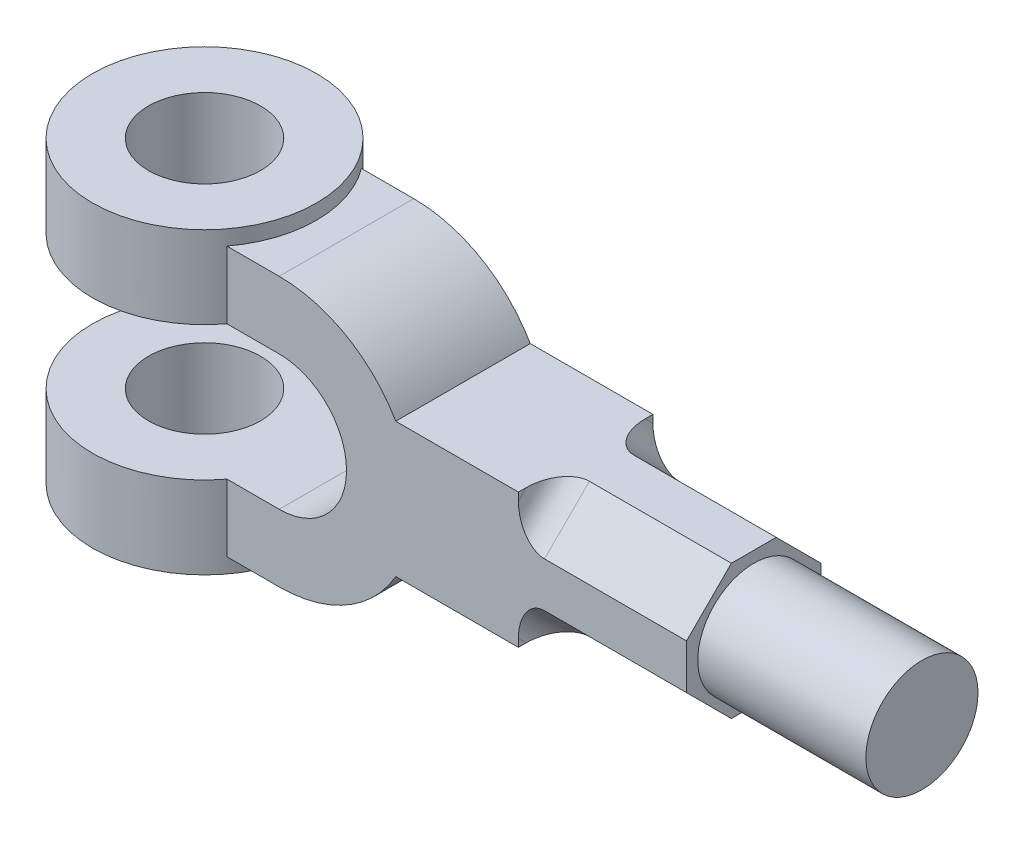
ISO-10303-21;
HEADER;
FILE_DESCRIPTION(('STEP AP214'),'2;1');
FILE_NAME('part.step','',(''),(''),'','','');
FILE_SCHEMA(('AUTOMOTIVE_DESIGN { 1 0 10303 214 1 1 1 1 }'));
ENDSEC;
DATA;
#1=APPLICATION_CONTEXT('core data for automotive mechanical design processes');
#2=APPLICATION_PROTOCOL_DEFINITION('international standard','automotive_design',2000,#1);
#3=PRODUCT_CONTEXT('',#1,'mechanical');
#4=PRODUCT('Part','Part','',(#3));
#5=PRODUCT_RELATED_PRODUCT_CATEGORY('part','',(#4));
#6=PRODUCT_DEFINITION_FORMATION('','',#4);
#7=PRODUCT_DEFINITION_CONTEXT('part definition',#1,'design');
#8=PRODUCT_DEFINITION('design','',#6,#7);
#9=PRODUCT_DEFINITION_SHAPE('','',#8);
#10=(LENGTH_UNIT() NAMED_UNIT(*) SI_UNIT(.MILLI.,.METRE.));
#11=(NAMED_UNIT(*) PLANE_ANGLE_UNIT() SI_UNIT($,.RADIAN.));
#12=(NAMED_UNIT(*) SI_UNIT($,.STERADIAN.) SOLID_ANGLE_UNIT());
#13=UNCERTAINTY_MEASURE_WITH_UNIT(LENGTH_MEASURE(1.E-05),#10,'distance_accuracy_value','');
#14=(GEOMETRIC_REPRESENTATION_CONTEXT(3) GLOBAL_UNCERTAINTY_ASSIGNED_CONTEXT((#13)) GLOBAL_UNIT_ASSIGNED_CONTEXT((#10,
#11,#12)) REPRESENTATION_CONTEXT('',''));
#15=CARTESIAN_POINT('',(0.,0.,0.));
#16=DIRECTION('',(0.,0.,1.));
#17=DIRECTION('',(1.,0.,0.));
#18=AXIS2_PLACEMENT_3D('',#15,#16,#17);
#19=CARTESIAN_POINT('',(0.,0.,18.));
#20=DIRECTION('',(0.,0.,-1.));
#21=DIRECTION('',(-1.,0.,0.));
#22=AXIS2_PLACEMENT_3D('',#19,#20,#21);
#23=CYLINDRICAL_SURFACE('',#22,36.);
#24=CARTESIAN_POINT('',(0.,0.,-18.));
#25=DIRECTION('',(0.,0.,1.));
#26=DIRECTION('',(1.,0.,0.));
#27=AXIS2_PLACEMENT_3D('',#24,#25,#26);
#28=CIRCLE('',#27,36.);
#29=CARTESIAN_POINT('',(31.1769145362398,18.,-18.));
#30=VERTEX_POINT('',#29);
#31=CARTESIAN_POINT('',(0.,36.,-18.));
#32=VERTEX_POINT('',#31);
#33=EDGE_CURVE('E486',#30,#32,#28,.T.);
#34=ORIENTED_EDGE('',*,*,#33,.T.);
#35=DIRECTION('',(0.,0.,-1.));
#36=VECTOR('',#35,1.);
#37=CARTESIAN_POINT('',(0.,36.,18.));
#38=LINE('',#37,#36);
#39=CARTESIAN_POINT('',(0.,36.,18.));
#40=VERTEX_POINT('',#39);
#41=EDGE_CURVE('E278',#40,#32,#38,.T.);
#42=ORIENTED_EDGE('',*,*,#41,.F.);
#43=CARTESIAN_POINT('',(0.,0.,18.));
#44=DIRECTION('',(0.,0.,1.));
#45=DIRECTION('',(1.,0.,0.));
#46=AXIS2_PLACEMENT_3D('',#43,#44,#45);
#47=CIRCLE('',#46,36.);
#48=CARTESIAN_POINT('',(31.1769145362398,18.,18.));
#49=VERTEX_POINT('',#48);
#50=EDGE_CURVE('E244',#49,#40,#47,.T.);
#51=ORIENTED_EDGE('',*,*,#50,.F.);
#52=DIRECTION('',(0.,0.,-1.));
#53=VECTOR('',#52,1.);
#54=CARTESIAN_POINT('',(31.1769145362398,18.,18.));
#55=LINE('',#54,#53);
#56=EDGE_CURVE('E251',#49,#30,#55,.T.);
#57=ORIENTED_EDGE('',*,*,#56,.T.);
#58=EDGE_LOOP('',(#34,#42,#51,#57));
#59=FACE_BOUND('',#58,.T.);
#60=ADVANCED_FACE('F43',(#59),#23,.T.);
#61=CARTESIAN_POINT('',(0.,36.,18.));
#62=DIRECTION('',(0.,-1.,0.));
#63=DIRECTION('',(1.,0.,0.));
#64=AXIS2_PLACEMENT_3D('',#61,#62,#63);
#65=PLANE('',#64);
#66=DIRECTION('',(-1.,0.,0.));
#67=VECTOR('',#66,1.);
#68=CARTESIAN_POINT('',(0.,36.,-18.));
#69=LINE('',#68,#67);
#70=CARTESIAN_POINT('',(-14.,36.,-18.));
#71=VERTEX_POINT('',#70);
#72=EDGE_CURVE('E521',#32,#71,#69,.T.);
#73=ORIENTED_EDGE('',*,*,#72,.T.);
#74=CARTESIAN_POINT('',(-38.,36.,0.));
#75=DIRECTION('',(0.,-1.,0.));
#76=DIRECTION('',(1.,0.,0.));
#77=AXIS2_PLACEMENT_3D('',#74,#75,#76);
#78=CIRCLE('',#77,30.);
#79=CARTESIAN_POINT('',(-14.,36.,18.));
#80=VERTEX_POINT('',#79);
#81=EDGE_CURVE('E477',#71,#80,#78,.T.);
#82=ORIENTED_EDGE('',*,*,#81,.T.);
#83=DIRECTION('',(-1.,0.,0.));
#84=VECTOR('',#83,1.);
#85=CARTESIAN_POINT('',(0.,36.,18.));
#86=LINE('',#85,#84);
#87=EDGE_CURVE('E490',#40,#80,#86,.T.);
#88=ORIENTED_EDGE('',*,*,#87,.F.);
#89=ORIENTED_EDGE('',*,*,#41,.T.);
#90=EDGE_LOOP('',(#73,#82,#88,#89));
#91=FACE_BOUND('',#90,.T.);
#92=ADVANCED_FACE('F365',(#91),#65,.F.);
#93=CARTESIAN_POINT('',(0.,18.,18.));
#94=DIRECTION('',(0.,1.,0.));
#95=DIRECTION('',(0.,0.,1.));
#96=AXIS2_PLACEMENT_3D('',#93,#94,#95);
#97=PLANE('',#96);
#98=CARTESIAN_POINT('',(-38.,18.,0.));
#99=DIRECTION('',(0.,1.,0.));
#100=DIRECTION('',(0.,0.,1.));
#101=AXIS2_PLACEMENT_3D('',#98,#99,#100);
#102=CIRCLE('',#101,15.);
#103=CARTESIAN_POINT('',(-38.,18.,15.));
#104=VERTEX_POINT('',#103);
#105=EDGE_CURVE('E453',#104,#104,#102,.T.);
#106=ORIENTED_EDGE('',*,*,#105,.T.);
#107=EDGE_LOOP('',(#106));
#108=FACE_BOUND('',#107,.T.);
#109=DIRECTION('',(1.,0.,0.));
#110=VECTOR('',#109,1.);
#111=CARTESIAN_POINT('',(0.,18.,18.));
#112=LINE('',#111,#110);
#113=CARTESIAN_POINT('',(-14.,18.,18.));
#114=VERTEX_POINT('',#113);
#115=CARTESIAN_POINT('',(0.,18.,18.));
#116=VERTEX_POINT('',#115);
#117=EDGE_CURVE('E494',#114,#116,#112,.T.);
#118=ORIENTED_EDGE('',*,*,#117,.F.);
#119=CARTESIAN_POINT('',(-38.,18.,0.));
#120=DIRECTION('',(0.,-1.,0.));
#121=DIRECTION('',(0.,0.,-1.));
#122=AXIS2_PLACEMENT_3D('',#119,#120,#121);
#123=CIRCLE('',#122,30.);
#124=CARTESIAN_POINT('',(-14.,18.,-18.));
#125=VERTEX_POINT('',#124);
#126=EDGE_CURVE('E472',#114,#125,#123,.T.);
#127=ORIENTED_EDGE('',*,*,#126,.T.);
#128=DIRECTION('',(1.,0.,0.));
#129=VECTOR('',#128,1.);
#130=CARTESIAN_POINT('',(0.,18.,-18.));
#131=LINE('',#130,#129);
#132=CARTESIAN_POINT('',(0.,18.,-18.));
#133=VERTEX_POINT('',#132);
#134=EDGE_CURVE('E525',#125,#133,#131,.T.);
#135=ORIENTED_EDGE('',*,*,#134,.T.);
#136=DIRECTION('',(0.,0.,-1.));
#137=VECTOR('',#136,1.);
#138=CARTESIAN_POINT('',(0.,18.,18.));
#139=LINE('',#138,#137);
#140=EDGE_CURVE('E274',#116,#133,#139,.T.);
#141=ORIENTED_EDGE('',*,*,#140,.F.);
#142=EDGE_LOOP('',(#118,#127,#135,#141));
#143=FACE_BOUND('',#142,.T.);
#144=ADVANCED_FACE('F371',(#108,#143),#97,.F.);
#145=CARTESIAN_POINT('',(0.,0.,18.));
#146=DIRECTION('',(0.,0.,-1.));
#147=DIRECTION('',(-1.,0.,0.));
#148=AXIS2_PLACEMENT_3D('',#145,#146,#147);
#149=CYLINDRICAL_SURFACE('',#148,18.);
#150=CARTESIAN_POINT('',(0.,0.,-18.));
#151=DIRECTION('',(0.,0.,-1.));
#152=DIRECTION('',(1.,0.,0.));
#153=AXIS2_PLACEMENT_3D('',#150,#151,#152);
#154=CIRCLE('',#153,18.);
#155=CARTESIAN_POINT('',(0.,-18.,-18.));
#156=VERTEX_POINT('',#155);
#157=EDGE_CURVE('E528',#133,#156,#154,.T.);
#158=ORIENTED_EDGE('',*,*,#157,.T.);
#159=DIRECTION('',(0.,0.,-1.));
#160=VECTOR('',#159,1.);
#161=CARTESIAN_POINT('',(0.,-18.,18.));
#162=LINE('',#161,#160);
#163=CARTESIAN_POINT('',(0.,-18.,18.));
#164=VERTEX_POINT('',#163);
#165=EDGE_CURVE('E270',#164,#156,#162,.T.);
#166=ORIENTED_EDGE('',*,*,#165,.F.);
#167=CARTESIAN_POINT('',(0.,0.,18.));
#168=DIRECTION('',(0.,0.,-1.));
#169=DIRECTION('',(1.,0.,0.));
#170=AXIS2_PLACEMENT_3D('',#167,#168,#169);
#171=CIRCLE('',#170,18.);
#172=EDGE_CURVE('E497',#116,#164,#171,.T.);
#173=ORIENTED_EDGE('',*,*,#172,.F.);
#174=ORIENTED_EDGE('',*,*,#140,.T.);
#175=EDGE_LOOP('',(#158,#166,#173,#174));
#176=FACE_BOUND('',#175,.T.);
#177=ADVANCED_FACE('F563',(#176),#149,.F.);
#178=CARTESIAN_POINT('',(0.,-18.,18.));
#179=DIRECTION('',(0.,-1.,0.));
#180=DIRECTION('',(1.,0.,0.));
#181=AXIS2_PLACEMENT_3D('',#178,#179,#180);
#182=PLANE('',#181);
#183=CARTESIAN_POINT('',(-38.,-18.,0.));
#184=DIRECTION('',(0.,-1.,0.));
#185=DIRECTION('',(1.,0.,0.));
#186=AXIS2_PLACEMENT_3D('',#183,#184,#185);
#187=CIRCLE('',#186,15.);
#188=CARTESIAN_POINT('',(-23.,-18.,0.));
#189=VERTEX_POINT('',#188);
#190=EDGE_CURVE('E446',#189,#189,#187,.T.);
#191=ORIENTED_EDGE('',*,*,#190,.T.);
#192=EDGE_LOOP('',(#191));
#193=FACE_BOUND('',#192,.T.);
#194=DIRECTION('',(-1.,0.,0.));
#195=VECTOR('',#194,1.);
#196=CARTESIAN_POINT('',(0.,-18.,-18.));
#197=LINE('',#196,#195);
#198=CARTESIAN_POINT('',(-14.,-18.,-18.));
#199=VERTEX_POINT('',#198);
#200=EDGE_CURVE('E531',#156,#199,#197,.T.);
#201=ORIENTED_EDGE('',*,*,#200,.T.);
#202=CARTESIAN_POINT('',(-38.,-18.,0.));
#203=DIRECTION('',(0.,1.,0.));
#204=DIRECTION('',(-1.,0.,0.));
#205=AXIS2_PLACEMENT_3D('',#202,#203,#204);
#206=CIRCLE('',#205,30.);
#207=CARTESIAN_POINT('',(-14.,-18.,18.));
#208=VERTEX_POINT('',#207);
#209=EDGE_CURVE('E457',#199,#208,#206,.T.);
#210=ORIENTED_EDGE('',*,*,#209,.T.);
#211=DIRECTION('',(-1.,0.,0.));
#212=VECTOR('',#211,1.);
#213=CARTESIAN_POINT('',(0.,-18.,18.));
#214=LINE('',#213,#212);
#215=EDGE_CURVE('E500',#164,#208,#214,.T.);
#216=ORIENTED_EDGE('',*,*,#215,.F.);
#217=ORIENTED_EDGE('',*,*,#165,.T.);
#218=EDGE_LOOP('',(#201,#210,#216,#217));
#219=FACE_BOUND('',#218,.T.);
#220=ADVANCED_FACE('F558',(#193,#219),#182,.F.);
#221=CARTESIAN_POINT('',(0.,-36.,18.));
#222=DIRECTION('',(0.,1.,0.));
#223=DIRECTION('',(0.,0.,1.));
#224=AXIS2_PLACEMENT_3D('',#221,#222,#223);
#225=PLANE('',#224);
#226=DIRECTION('',(1.,0.,0.));
#227=VECTOR('',#226,1.);
#228=CARTESIAN_POINT('',(0.,-36.,18.));
#229=LINE('',#228,#227);
#230=CARTESIAN_POINT('',(-14.,-36.,18.));
#231=VERTEX_POINT('',#230);
#232=CARTESIAN_POINT('',(0.,-36.,18.));
#233=VERTEX_POINT('',#232);
#234=EDGE_CURVE('E504',#231,#233,#229,.T.);
#235=ORIENTED_EDGE('',*,*,#234,.F.);
#236=CARTESIAN_POINT('',(-38.,-36.,0.));
#237=DIRECTION('',(0.,1.,0.));
#238=DIRECTION('',(0.,0.,1.));
#239=AXIS2_PLACEMENT_3D('',#236,#237,#238);
#240=CIRCLE('',#239,30.);
#241=CARTESIAN_POINT('',(-14.,-36.,-18.));
#242=VERTEX_POINT('',#241);
#243=EDGE_CURVE('E462',#231,#242,#240,.T.);
#244=ORIENTED_EDGE('',*,*,#243,.T.);
#245=DIRECTION('',(1.,0.,0.));
#246=VECTOR('',#245,1.);
#247=CARTESIAN_POINT('',(0.,-36.,-18.));
#248=LINE('',#247,#246);
#249=CARTESIAN_POINT('',(0.,-36.,-18.));
#250=VERTEX_POINT('',#249);
#251=EDGE_CURVE('E535',#242,#250,#248,.T.);
#252=ORIENTED_EDGE('',*,*,#251,.T.);
#253=DIRECTION('',(0.,0.,-1.));
#254=VECTOR('',#253,1.);
#255=CARTESIAN_POINT('',(0.,-36.,18.));
#256=LINE('',#255,#254);
#257=EDGE_CURVE('E266',#233,#250,#256,.T.);
#258=ORIENTED_EDGE('',*,*,#257,.F.);
#259=EDGE_LOOP('',(#235,#244,#252,#258));
#260=FACE_BOUND('',#259,.T.);
#261=ADVANCED_FACE('F553',(#260),#225,.F.);
#262=CARTESIAN_POINT('',(0.,0.,18.));
#263=DIRECTION('',(0.,0.,-1.));
#264=DIRECTION('',(-1.,0.,0.));
#265=AXIS2_PLACEMENT_3D('',#262,#263,#264);
#266=CYLINDRICAL_SURFACE('',#265,36.);
#267=CARTESIAN_POINT('',(0.,0.,-18.));
#268=DIRECTION('',(0.,0.,1.));
#269=DIRECTION('',(1.,0.,0.));
#270=AXIS2_PLACEMENT_3D('',#267,#268,#269);
#271=CIRCLE('',#270,36.);
#272=CARTESIAN_POINT('',(31.1769145362398,-18.,-18.));
#273=VERTEX_POINT('',#272);
#274=EDGE_CURVE('E247',#250,#273,#271,.T.);
#275=ORIENTED_EDGE('',*,*,#274,.T.);
#276=DIRECTION('',(0.,0.,-1.));
#277=VECTOR('',#276,1.);
#278=CARTESIAN_POINT('',(31.1769145362398,-18.,18.));
#279=LINE('',#278,#277);
#280=CARTESIAN_POINT('',(31.1769145362398,-18.,18.));
#281=VERTEX_POINT('',#280);
#282=EDGE_CURVE('E262',#281,#273,#279,.T.);
#283=ORIENTED_EDGE('',*,*,#282,.F.);
#284=CARTESIAN_POINT('',(0.,0.,18.));
#285=DIRECTION('',(0.,0.,1.));
#286=DIRECTION('',(1.,0.,0.));
#287=AXIS2_PLACEMENT_3D('',#284,#285,#286);
#288=CIRCLE('',#287,36.);
#289=EDGE_CURVE('E507',#233,#281,#288,.T.);
#290=ORIENTED_EDGE('',*,*,#289,.F.);
#291=ORIENTED_EDGE('',*,*,#257,.T.);
#292=EDGE_LOOP('',(#275,#283,#290,#291));
#293=FACE_BOUND('',#292,.T.);
#294=ADVANCED_FACE('F541',(#293),#266,.T.);
#295=CARTESIAN_POINT('',(31.1769145362398,-18.,18.));
#296=DIRECTION('',(0.,1.,0.));
#297=DIRECTION('',(0.,0.,1.));
#298=AXIS2_PLACEMENT_3D('',#295,#296,#297);
#299=PLANE('',#298);
#300=DIRECTION('',(0.,0.,-1.));
#301=VECTOR('',#300,1.);
#302=CARTESIAN_POINT('',(109.,-18.,18.));
#303=LINE('',#302,#301);
#304=CARTESIAN_POINT('',(109.,-18.0000000000002,5.9999999999995));
#305=VERTEX_POINT('',#304);
#306=CARTESIAN_POINT('',(109.,-17.9999999999998,-6.00000000000033));
#307=VERTEX_POINT('',#306);
#308=EDGE_CURVE('E229',#305,#307,#303,.T.);
#309=ORIENTED_EDGE('',*,*,#308,.F.);
#310=DIRECTION('',(1.,0.,0.));
#311=VECTOR('',#310,1.);
#312=CARTESIAN_POINT('',(64.,-18.0000000000002,5.9999999999995));
#313=LINE('',#312,#311);
#314=CARTESIAN_POINT('',(71.,-18.0000000000002,5.9999999999995));
#315=VERTEX_POINT('',#314);
#316=EDGE_CURVE('E404',#315,#305,#313,.T.);
#317=ORIENTED_EDGE('',*,*,#316,.F.);
#318=CARTESIAN_POINT('',(71.,-18.,15.8994949366113));
#319=DIRECTION('',(0.,1.,0.));
#320=DIRECTION('',(0.,0.,1.));
#321=AXIS2_PLACEMENT_3D('',#318,#319,#320);
#322=ELLIPSE('',#321,9.89949493661167,7.);
#323=CARTESIAN_POINT('',(64.,-18.0000000000002,15.8994949366112));
#324=VERTEX_POINT('',#323);
#325=EDGE_CURVE('E319',#315,#324,#322,.T.);
#326=ORIENTED_EDGE('',*,*,#325,.T.);
#327=DIRECTION('',(0.,0.,-1.));
#328=VECTOR('',#327,1.);
#329=CARTESIAN_POINT('',(64.,-18.0000000000002,17.9999999999995));
#330=LINE('',#329,#328);
#331=CARTESIAN_POINT('',(64.,-18.0000000000002,17.9999999999995));
#332=VERTEX_POINT('',#331);
#333=EDGE_CURVE('E403',#332,#324,#330,.T.);
#334=ORIENTED_EDGE('',*,*,#333,.F.);
#335=DIRECTION('',(1.,0.,0.));
#336=VECTOR('',#335,1.);
#337=CARTESIAN_POINT('',(31.1769145362398,-18.,18.));
#338=LINE('',#337,#336);
#339=EDGE_CURVE('E510',#281,#332,#338,.T.);
#340=ORIENTED_EDGE('',*,*,#339,.F.);
#341=ORIENTED_EDGE('',*,*,#282,.T.);
#342=DIRECTION('',(1.,0.,0.));
#343=VECTOR('',#342,1.);
#344=CARTESIAN_POINT('',(31.1769145362398,-18.,-18.));
#345=LINE('',#344,#343);
#346=CARTESIAN_POINT('',(64.,-18.,-18.));
#347=VERTEX_POINT('',#346);
#348=EDGE_CURVE('E240',#273,#347,#345,.T.);
#349=ORIENTED_EDGE('',*,*,#348,.T.);
#350=DIRECTION('',(0.,0.,-1.));
#351=VECTOR('',#350,1.);
#352=CARTESIAN_POINT('',(64.,-17.9999999999998,-6.00000000000033));
#353=LINE('',#352,#351);
#354=CARTESIAN_POINT('',(64.,-17.9999999999998,-15.899494936612));
#355=VERTEX_POINT('',#354);
#356=EDGE_CURVE('E232',#355,#347,#353,.T.);
#357=ORIENTED_EDGE('',*,*,#356,.F.);
#358=CARTESIAN_POINT('',(71.,-18.,-15.8994949366118));
#359=DIRECTION('',(0.,1.,0.));
#360=DIRECTION('',(0.,0.,1.));
#361=AXIS2_PLACEMENT_3D('',#358,#359,#360);
#362=ELLIPSE('',#361,9.89949493661167,7.);
#363=CARTESIAN_POINT('',(71.,-17.9999999999998,-6.00000000000033));
#364=VERTEX_POINT('',#363);
#365=EDGE_CURVE('E322',#355,#364,#362,.T.);
#366=ORIENTED_EDGE('',*,*,#365,.T.);
#367=DIRECTION('',(1.,0.,0.));
#368=VECTOR('',#367,1.);
#369=CARTESIAN_POINT('',(64.,-17.9999999999998,-6.00000000000033));
#370=LINE('',#369,#368);
#371=EDGE_CURVE('E218',#364,#307,#370,.T.);
#372=ORIENTED_EDGE('',*,*,#371,.T.);
#373=EDGE_LOOP('',(#309,#317,#326,#334,#340,#341,#349,#357,#366,#372));
#374=FACE_BOUND('',#373,.T.);
#375=ADVANCED_FACE('F547',(#374),#299,.F.);
#376=CARTESIAN_POINT('',(109.,18.,18.));
#377=DIRECTION('',(-1.,0.,0.));
#378=DIRECTION('',(0.,0.,1.));
#379=AXIS2_PLACEMENT_3D('',#376,#377,#378);
#380=PLANE('',#379);
#381=CARTESIAN_POINT('',(109.,0.,0.));
#382=DIRECTION('',(1.,0.,0.));
#383=DIRECTION('',(0.,0.,-1.));
#384=AXIS2_PLACEMENT_3D('',#381,#382,#383);
#385=CIRCLE('',#384,15.);
#386=CARTESIAN_POINT('',(109.,0.,-15.));
#387=VERTEX_POINT('',#386);
#388=EDGE_CURVE('E11',#387,#387,#385,.T.);
#389=ORIENTED_EDGE('',*,*,#388,.F.);
#390=EDGE_LOOP('',(#389));
#391=FACE_BOUND('',#390,.T.);
#392=DIRECTION('',(0.,0.,-1.));
#393=VECTOR('',#392,1.);
#394=CARTESIAN_POINT('',(109.,18.,18.));
#395=LINE('',#394,#393);
#396=CARTESIAN_POINT('',(109.,18.0000000000001,5.99999999999981));
#397=VERTEX_POINT('',#396);
#398=CARTESIAN_POINT('',(109.,18.,-6.));
#399=VERTEX_POINT('',#398);
#400=EDGE_CURVE('E255',#397,#399,#395,.T.);
#401=ORIENTED_EDGE('',*,*,#400,.F.);
#402=DIRECTION('',(0.,0.707106781186559,-0.707106781186536));
#403=VECTOR('',#402,1.);
#404=CARTESIAN_POINT('',(109.,5.99999999999966,17.9999999999998));
#405=LINE('',#404,#403);
#406=CARTESIAN_POINT('',(109.,5.99999999999966,17.9999999999998));
#407=VERTEX_POINT('',#406);
#408=EDGE_CURVE('E407',#407,#397,#405,.T.);
#409=ORIENTED_EDGE('',*,*,#408,.F.);
#410=DIRECTION('',(0.,1.,0.));
#411=VECTOR('',#410,1.);
#412=CARTESIAN_POINT('',(109.,18.,18.));
#413=LINE('',#412,#411);
#414=CARTESIAN_POINT('',(109.,-6.00000000000017,17.9999999999995));
#415=VERTEX_POINT('',#414);
#416=EDGE_CURVE('E514',#415,#407,#413,.T.);
#417=ORIENTED_EDGE('',*,*,#416,.F.);
#418=DIRECTION('',(0.,0.707106781186547,0.707106781186548));
#419=VECTOR('',#418,1.);
#420=CARTESIAN_POINT('',(109.,-18.0000000000002,5.9999999999995));
#421=LINE('',#420,#419);
#422=EDGE_CURVE('E219',#305,#415,#421,.T.);
#423=ORIENTED_EDGE('',*,*,#422,.F.);
#424=ORIENTED_EDGE('',*,*,#308,.T.);
#425=DIRECTION('',(0.,-0.707106781186548,0.707106781186548));
#426=VECTOR('',#425,1.);
#427=CARTESIAN_POINT('',(109.,-5.99999999999983,-18.0000000000003));
#428=LINE('',#427,#426);
#429=CARTESIAN_POINT('',(109.,-5.99999999999983,-18.0000000000003));
#430=VERTEX_POINT('',#429);
#431=EDGE_CURVE('E210',#430,#307,#428,.T.);
#432=ORIENTED_EDGE('',*,*,#431,.F.);
#433=DIRECTION('',(0.,1.,0.));
#434=VECTOR('',#433,1.);
#435=CARTESIAN_POINT('',(109.,18.,-18.));
#436=LINE('',#435,#434);
#437=CARTESIAN_POINT('',(109.,6.,-18.));
#438=VERTEX_POINT('',#437);
#439=EDGE_CURVE('E226',#430,#438,#436,.T.);
#440=ORIENTED_EDGE('',*,*,#439,.T.);
#441=DIRECTION('',(0.,-0.707106781186548,-0.707106781186548));
#442=VECTOR('',#441,1.);
#443=CARTESIAN_POINT('',(109.,18.,-6.));
#444=LINE('',#443,#442);
#445=EDGE_CURVE('E231',#399,#438,#444,.T.);
#446=ORIENTED_EDGE('',*,*,#445,.F.);
#447=EDGE_LOOP('',(#401,#409,#417,#423,#424,#432,#440,#446));
#448=FACE_BOUND('',#447,.T.);
#449=ADVANCED_FACE('F224',(#391,#448),#380,.F.);
#450=CARTESIAN_POINT('',(31.1769145362398,18.,18.));
#451=DIRECTION('',(0.,-1.,0.));
#452=DIRECTION('',(0.,0.,-1.));
#453=AXIS2_PLACEMENT_3D('',#450,#451,#452);
#454=PLANE('',#453);
#455=DIRECTION('',(0.,0.,1.));
#456=VECTOR('',#455,1.);
#457=CARTESIAN_POINT('',(64.,18.0000000000001,5.99999999999981));
#458=LINE('',#457,#456);
#459=CARTESIAN_POINT('',(64.,17.9999999999997,15.8994949366116));
#460=VERTEX_POINT('',#459);
#461=CARTESIAN_POINT('',(64.,18.,18.));
#462=VERTEX_POINT('',#461);
#463=EDGE_CURVE('E348',#460,#462,#458,.T.);
#464=ORIENTED_EDGE('',*,*,#463,.F.);
#465=CARTESIAN_POINT('',(71.,18.,15.8994949366114));
#466=DIRECTION('',(0.,-1.,0.));
#467=DIRECTION('',(0.,0.,-1.));
#468=AXIS2_PLACEMENT_3D('',#465,#466,#467);
#469=ELLIPSE('',#468,9.89949493661151,7.);
#470=CARTESIAN_POINT('',(71.,18.0000000000001,5.99999999999981));
#471=VERTEX_POINT('',#470);
#472=EDGE_CURVE('E68',#460,#471,#469,.T.);
#473=ORIENTED_EDGE('',*,*,#472,.T.);
#474=DIRECTION('',(1.,0.,0.));
#475=VECTOR('',#474,1.);
#476=CARTESIAN_POINT('',(64.,18.0000000000001,5.99999999999981));
#477=LINE('',#476,#475);
#478=EDGE_CURVE('E350',#471,#397,#477,.T.);
#479=ORIENTED_EDGE('',*,*,#478,.T.);
#480=ORIENTED_EDGE('',*,*,#400,.T.);
#481=DIRECTION('',(1.,0.,0.));
#482=VECTOR('',#481,1.);
#483=CARTESIAN_POINT('',(64.,18.,-6.));
#484=LINE('',#483,#482);
#485=CARTESIAN_POINT('',(71.,18.,-6.));
#486=VERTEX_POINT('',#485);
#487=EDGE_CURVE('E434',#486,#399,#484,.T.);
#488=ORIENTED_EDGE('',*,*,#487,.F.);
#489=CARTESIAN_POINT('',(71.,18.,-15.8994949366117));
#490=DIRECTION('',(0.,-1.,0.));
#491=DIRECTION('',(0.,0.,1.));
#492=AXIS2_PLACEMENT_3D('',#489,#490,#491);
#493=ELLIPSE('',#492,9.89949493661167,7.);
#494=CARTESIAN_POINT('',(64.,18.,-15.8994949366117));
#495=VERTEX_POINT('',#494);
#496=EDGE_CURVE('E331',#486,#495,#493,.T.);
#497=ORIENTED_EDGE('',*,*,#496,.T.);
#498=DIRECTION('',(0.,0.,1.));
#499=VECTOR('',#498,1.);
#500=CARTESIAN_POINT('',(64.,18.,-18.));
#501=LINE('',#500,#499);
#502=CARTESIAN_POINT('',(64.,18.,-18.));
#503=VERTEX_POINT('',#502);
#504=EDGE_CURVE('E427',#503,#495,#501,.T.);
#505=ORIENTED_EDGE('',*,*,#504,.F.);
#506=DIRECTION('',(-1.,0.,0.));
#507=VECTOR('',#506,1.);
#508=CARTESIAN_POINT('',(31.1769145362398,18.,-18.));
#509=LINE('',#508,#507);
#510=EDGE_CURVE('E239',#503,#30,#509,.T.);
#511=ORIENTED_EDGE('',*,*,#510,.T.);
#512=ORIENTED_EDGE('',*,*,#56,.F.);
#513=DIRECTION('',(-1.,0.,0.));
#514=VECTOR('',#513,1.);
#515=CARTESIAN_POINT('',(31.1769145362398,18.,18.));
#516=LINE('',#515,#514);
#517=EDGE_CURVE('E256',#462,#49,#516,.T.);
#518=ORIENTED_EDGE('',*,*,#517,.F.);
#519=EDGE_LOOP('',(#464,#473,#479,#480,#488,#497,#505,#511,#512,#518));
#520=FACE_BOUND('',#519,.T.);
#521=ADVANCED_FACE('F579',(#520),#454,.F.);
#522=CARTESIAN_POINT('',(0.,0.,18.));
#523=DIRECTION('',(0.,0.,1.));
#524=DIRECTION('',(1.,0.,0.));
#525=AXIS2_PLACEMENT_3D('',#522,#523,#524);
#526=PLANE('',#525);
#527=DIRECTION('',(1.,0.,0.));
#528=VECTOR('',#527,1.);
#529=CARTESIAN_POINT('',(64.,5.99999999999966,17.9999999999998));
#530=LINE('',#529,#528);
#531=CARTESIAN_POINT('',(71.,5.99999999999966,17.9999999999998));
#532=VERTEX_POINT('',#531);
#533=EDGE_CURVE('E343',#532,#407,#530,.T.);
#534=ORIENTED_EDGE('',*,*,#533,.F.);
#535=CARTESIAN_POINT('',(71.,15.8994949366113,18.));
#536=DIRECTION('',(0.,0.,1.));
#537=DIRECTION('',(0.,1.,0.));
#538=AXIS2_PLACEMENT_3D('',#535,#536,#537);
#539=ELLIPSE('',#538,9.89949493661182,7.);
#540=CARTESIAN_POINT('',(64.,15.8994949366115,17.9999999999998));
#541=VERTEX_POINT('',#540);
#542=EDGE_CURVE('E47',#532,#541,#539,.F.);
#543=ORIENTED_EDGE('',*,*,#542,.T.);
#544=DIRECTION('',(0.,-1.,0.));
#545=VECTOR('',#544,1.);
#546=CARTESIAN_POINT('',(64.,17.9999999999997,17.9999999999998));
#547=LINE('',#546,#545);
#548=EDGE_CURVE('E340',#462,#541,#547,.T.);
#549=ORIENTED_EDGE('',*,*,#548,.F.);
#550=ORIENTED_EDGE('',*,*,#517,.T.);
#551=ORIENTED_EDGE('',*,*,#50,.T.);
#552=ORIENTED_EDGE('',*,*,#87,.T.);
#553=DIRECTION('',(0.,-1.,0.));
#554=VECTOR('',#553,1.);
#555=CARTESIAN_POINT('',(-14.,40.,18.));
#556=LINE('',#555,#554);
#557=EDGE_CURVE('E483',#114,#80,#556,.F.);
#558=ORIENTED_EDGE('',*,*,#557,.F.);
#559=ORIENTED_EDGE('',*,*,#117,.T.);
#560=ORIENTED_EDGE('',*,*,#172,.T.);
#561=ORIENTED_EDGE('',*,*,#215,.T.);
#562=DIRECTION('',(0.,1.,0.));
#563=VECTOR('',#562,1.);
#564=CARTESIAN_POINT('',(-14.,-40.,18.));
#565=LINE('',#564,#563);
#566=EDGE_CURVE('E469',#231,#208,#565,.T.);
#567=ORIENTED_EDGE('',*,*,#566,.F.);
#568=ORIENTED_EDGE('',*,*,#234,.T.);
#569=ORIENTED_EDGE('',*,*,#289,.T.);
#570=ORIENTED_EDGE('',*,*,#339,.T.);
#571=DIRECTION('',(0.,-1.,0.));
#572=VECTOR('',#571,1.);
#573=CARTESIAN_POINT('',(64.,-6.00000000000017,17.9999999999995));
#574=LINE('',#573,#572);
#575=CARTESIAN_POINT('',(64.,-15.8994949366118,17.9999999999995));
#576=VERTEX_POINT('',#575);
#577=EDGE_CURVE('E411',#576,#332,#574,.T.);
#578=ORIENTED_EDGE('',*,*,#577,.F.);
#579=CARTESIAN_POINT('',(71.,-15.8994949366113,18.));
#580=DIRECTION('',(0.,0.,1.));
#581=DIRECTION('',(0.,1.,0.));
#582=AXIS2_PLACEMENT_3D('',#579,#580,#581);
#583=ELLIPSE('',#582,9.89949493661166,7.);
#584=CARTESIAN_POINT('',(71.,-6.00000000000017,17.9999999999995));
#585=VERTEX_POINT('',#584);
#586=EDGE_CURVE('E316',#576,#585,#583,.F.);
#587=ORIENTED_EDGE('',*,*,#586,.T.);
#588=DIRECTION('',(1.,0.,0.));
#589=VECTOR('',#588,1.);
#590=CARTESIAN_POINT('',(64.,-6.00000000000017,17.9999999999995));
#591=LINE('',#590,#589);
#592=EDGE_CURVE('E400',#585,#415,#591,.T.);
#593=ORIENTED_EDGE('',*,*,#592,.T.);
#594=ORIENTED_EDGE('',*,*,#416,.T.);
#595=EDGE_LOOP('',(#534,#543,#549,#550,#551,#552,#558,#559,#560,#561,#567,#568,#569,#570,#578,
#587,#593,#594));
#596=FACE_BOUND('',#595,.T.);
#597=ADVANCED_FACE('F339',(#596),#526,.T.);
#598=CARTESIAN_POINT('',(0.,0.,-18.));
#599=DIRECTION('',(0.,0.,1.));
#600=DIRECTION('',(1.,0.,0.));
#601=AXIS2_PLACEMENT_3D('',#598,#599,#600);
#602=PLANE('',#601);
#603=ORIENTED_EDGE('',*,*,#439,.F.);
#604=DIRECTION('',(1.,0.,0.));
#605=VECTOR('',#604,1.);
#606=CARTESIAN_POINT('',(64.,-5.99999999999983,-18.0000000000003));
#607=LINE('',#606,#605);
#608=CARTESIAN_POINT('',(71.,-5.99999999999983,-18.0000000000003));
#609=VERTEX_POINT('',#608);
#610=EDGE_CURVE('E206',#609,#430,#607,.T.);
#611=ORIENTED_EDGE('',*,*,#610,.F.);
#612=CARTESIAN_POINT('',(71.,-15.8994949366118,-18.));
#613=DIRECTION('',(0.,0.,1.));
#614=DIRECTION('',(0.,-1.,0.));
#615=AXIS2_PLACEMENT_3D('',#612,#613,#614);
#616=ELLIPSE('',#615,9.89949493661167,7.);
#617=CARTESIAN_POINT('',(64.,-15.8994949366115,-18.0000000000003));
#618=VERTEX_POINT('',#617);
#619=EDGE_CURVE('E325',#609,#618,#616,.T.);
#620=ORIENTED_EDGE('',*,*,#619,.T.);
#621=DIRECTION('',(0.,1.,0.));
#622=VECTOR('',#621,1.);
#623=CARTESIAN_POINT('',(64.,-17.9999999999998,-18.0000000000003));
#624=LINE('',#623,#622);
#625=EDGE_CURVE('E389',#347,#618,#624,.T.);
#626=ORIENTED_EDGE('',*,*,#625,.F.);
#627=ORIENTED_EDGE('',*,*,#348,.F.);
#628=ORIENTED_EDGE('',*,*,#274,.F.);
#629=ORIENTED_EDGE('',*,*,#251,.F.);
#630=DIRECTION('',(0.,1.,0.));
#631=VECTOR('',#630,1.);
#632=CARTESIAN_POINT('',(-14.,-40.,-18.));
#633=LINE('',#632,#631);
#634=EDGE_CURVE('E286',#242,#199,#633,.T.);
#635=ORIENTED_EDGE('',*,*,#634,.T.);
#636=ORIENTED_EDGE('',*,*,#200,.F.);
#637=ORIENTED_EDGE('',*,*,#157,.F.);
#638=ORIENTED_EDGE('',*,*,#134,.F.);
#639=DIRECTION('',(0.,-1.,0.));
#640=VECTOR('',#639,1.);
#641=CARTESIAN_POINT('',(-14.,40.,-18.));
#642=LINE('',#641,#640);
#643=EDGE_CURVE('E282',#125,#71,#642,.F.);
#644=ORIENTED_EDGE('',*,*,#643,.T.);
#645=ORIENTED_EDGE('',*,*,#72,.F.);
#646=ORIENTED_EDGE('',*,*,#33,.F.);
#647=ORIENTED_EDGE('',*,*,#510,.F.);
#648=DIRECTION('',(0.,1.,0.));
#649=VECTOR('',#648,1.);
#650=CARTESIAN_POINT('',(64.,6.,-18.));
#651=LINE('',#650,#649);
#652=CARTESIAN_POINT('',(64.,15.8994949366117,-18.));
#653=VERTEX_POINT('',#652);
#654=EDGE_CURVE('E431',#653,#503,#651,.T.);
#655=ORIENTED_EDGE('',*,*,#654,.F.);
#656=CARTESIAN_POINT('',(71.,15.8994949366117,-18.));
#657=DIRECTION('',(0.,0.,1.));
#658=DIRECTION('',(0.,1.,0.));
#659=AXIS2_PLACEMENT_3D('',#656,#657,#658);
#660=ELLIPSE('',#659,9.89949493661167,7.);
#661=CARTESIAN_POINT('',(71.,6.,-18.));
#662=VERTEX_POINT('',#661);
#663=EDGE_CURVE('E328',#653,#662,#660,.T.);
#664=ORIENTED_EDGE('',*,*,#663,.T.);
#665=DIRECTION('',(1.,0.,0.));
#666=VECTOR('',#665,1.);
#667=CARTESIAN_POINT('',(64.,6.,-18.));
#668=LINE('',#667,#666);
#669=EDGE_CURVE('E236',#662,#438,#668,.T.);
#670=ORIENTED_EDGE('',*,*,#669,.T.);
#671=EDGE_LOOP('',(#603,#611,#620,#626,#627,#628,#629,#635,#636,#637,#638,#644,#645,#646,#647,
#655,#664,#670));
#672=FACE_BOUND('',#671,.T.);
#673=ADVANCED_FACE('F234',(#672),#602,.F.);
#674=CARTESIAN_POINT('',(-38.,40.,0.));
#675=DIRECTION('',(0.,-1.,0.));
#676=DIRECTION('',(0.,0.,-1.));
#677=AXIS2_PLACEMENT_3D('',#674,#675,#676);
#678=CYLINDRICAL_SURFACE('',#677,30.);
#679=CARTESIAN_POINT('',(-38.,40.,0.));
#680=DIRECTION('',(0.,-1.,0.));
#681=DIRECTION('',(0.,0.,-1.));
#682=AXIS2_PLACEMENT_3D('',#679,#680,#681);
#683=CIRCLE('',#682,30.);
#684=CARTESIAN_POINT('',(-38.,40.,-30.));
#685=VERTEX_POINT('',#684);
#686=EDGE_CURVE('E473',#685,#685,#683,.T.);
#687=ORIENTED_EDGE('',*,*,#686,.T.);
#688=EDGE_LOOP('',(#687));
#689=FACE_BOUND('',#688,.T.);
#690=ORIENTED_EDGE('',*,*,#126,.F.);
#691=ORIENTED_EDGE('',*,*,#557,.T.);
#692=ORIENTED_EDGE('',*,*,#81,.F.);
#693=ORIENTED_EDGE('',*,*,#643,.F.);
#694=EDGE_LOOP('',(#690,#691,#692,#693));
#695=FACE_BOUND('',#694,.T.);
#696=ADVANCED_FACE('F571',(#689,#695),#678,.T.);
#697=CARTESIAN_POINT('',(-38.,40.,0.));
#698=DIRECTION('',(0.,-1.,0.));
#699=DIRECTION('',(0.,0.,-1.));
#700=AXIS2_PLACEMENT_3D('',#697,#698,#699);
#701=PLANE('',#700);
#702=CARTESIAN_POINT('',(-38.,40.,0.));
#703=DIRECTION('',(0.,1.,0.));
#704=DIRECTION('',(0.,0.,1.));
#705=AXIS2_PLACEMENT_3D('',#702,#703,#704);
#706=CIRCLE('',#705,15.);
#707=CARTESIAN_POINT('',(-38.,40.,15.));
#708=VERTEX_POINT('',#707);
#709=EDGE_CURVE('E439',#708,#708,#706,.T.);
#710=ORIENTED_EDGE('',*,*,#709,.F.);
#711=EDGE_LOOP('',(#710));
#712=FACE_BOUND('',#711,.T.);
#713=ORIENTED_EDGE('',*,*,#686,.F.);
#714=EDGE_LOOP('',(#713));
#715=FACE_BOUND('',#714,.T.);
#716=ADVANCED_FACE('F628',(#712,#715),#701,.F.);
#717=CARTESIAN_POINT('',(-38.,-40.,0.));
#718=DIRECTION('',(0.,1.,0.));
#719=DIRECTION('',(-1.,0.,0.));
#720=AXIS2_PLACEMENT_3D('',#717,#718,#719);
#721=CYLINDRICAL_SURFACE('',#720,30.);
#722=CARTESIAN_POINT('',(-38.,-40.,0.));
#723=DIRECTION('',(0.,1.,0.));
#724=DIRECTION('',(-1.,0.,0.));
#725=AXIS2_PLACEMENT_3D('',#722,#723,#724);
#726=CIRCLE('',#725,30.);
#727=CARTESIAN_POINT('',(-68.,-40.,0.));
#728=VERTEX_POINT('',#727);
#729=EDGE_CURVE('E458',#728,#728,#726,.T.);
#730=ORIENTED_EDGE('',*,*,#729,.T.);
#731=EDGE_LOOP('',(#730));
#732=FACE_BOUND('',#731,.T.);
#733=ORIENTED_EDGE('',*,*,#243,.F.);
#734=ORIENTED_EDGE('',*,*,#566,.T.);
#735=ORIENTED_EDGE('',*,*,#209,.F.);
#736=ORIENTED_EDGE('',*,*,#634,.F.);
#737=EDGE_LOOP('',(#733,#734,#735,#736));
#738=FACE_BOUND('',#737,.T.);
#739=ADVANCED_FACE('F624',(#732,#738),#721,.T.);
#740=CARTESIAN_POINT('',(-38.,-40.,0.));
#741=DIRECTION('',(0.,1.,0.));
#742=DIRECTION('',(-1.,0.,0.));
#743=AXIS2_PLACEMENT_3D('',#740,#741,#742);
#744=PLANE('',#743);
#745=CARTESIAN_POINT('',(-38.,-40.,0.));
#746=DIRECTION('',(0.,1.,0.));
#747=DIRECTION('',(0.,0.,1.));
#748=AXIS2_PLACEMENT_3D('',#745,#746,#747);
#749=CIRCLE('',#748,15.);
#750=CARTESIAN_POINT('',(-38.,-40.,15.));
#751=VERTEX_POINT('',#750);
#752=EDGE_CURVE('E442',#751,#751,#749,.T.);
#753=ORIENTED_EDGE('',*,*,#752,.T.);
#754=EDGE_LOOP('',(#753));
#755=FACE_BOUND('',#754,.T.);
#756=ORIENTED_EDGE('',*,*,#729,.F.);
#757=EDGE_LOOP('',(#756));
#758=FACE_BOUND('',#757,.T.);
#759=ADVANCED_FACE('F621',(#755,#758),#744,.F.);
#760=CARTESIAN_POINT('',(-38.,-40.,0.));
#761=DIRECTION('',(0.,1.,0.));
#762=DIRECTION('',(0.,0.,1.));
#763=AXIS2_PLACEMENT_3D('',#760,#761,#762);
#764=CYLINDRICAL_SURFACE('',#763,15.);
#765=ORIENTED_EDGE('',*,*,#752,.F.);
#766=EDGE_LOOP('',(#765));
#767=FACE_BOUND('',#766,.T.);
#768=ORIENTED_EDGE('',*,*,#190,.F.);
#769=EDGE_LOOP('',(#768));
#770=FACE_BOUND('',#769,.T.);
#771=ADVANCED_FACE('F619',(#767,#770),#764,.F.);
#772=ORIENTED_EDGE('',*,*,#709,.T.);
#773=EDGE_LOOP('',(#772));
#774=FACE_BOUND('',#773,.T.);
#775=ORIENTED_EDGE('',*,*,#105,.F.);
#776=EDGE_LOOP('',(#775));
#777=FACE_BOUND('',#776,.T.);
#778=ADVANCED_FACE('F616',(#774,#777),#764,.F.);
#779=CARTESIAN_POINT('',(64.,18.,-6.));
#780=DIRECTION('',(0.,-0.707106781186547,0.707106781186547));
#781=DIRECTION('',(0.,-0.707106781186548,-0.707106781186548));
#782=AXIS2_PLACEMENT_3D('',#779,#780,#781);
#783=PLANE('',#782);
#784=ORIENTED_EDGE('',*,*,#669,.F.);
#785=DIRECTION('',(0.,-0.707106781186548,-0.707106781186548));
#786=VECTOR('',#785,1.);
#787=CARTESIAN_POINT('',(71.,18.,-6.));
#788=LINE('',#787,#786);
#789=EDGE_CURVE('E307',#662,#486,#788,.F.);
#790=ORIENTED_EDGE('',*,*,#789,.T.);
#791=ORIENTED_EDGE('',*,*,#487,.T.);
#792=ORIENTED_EDGE('',*,*,#445,.T.);
#793=EDGE_LOOP('',(#784,#790,#791,#792));
#794=FACE_BOUND('',#793,.T.);
#795=ADVANCED_FACE('F587',(#794),#783,.F.);
#796=CARTESIAN_POINT('',(64.,0.,0.));
#797=DIRECTION('',(-1.,0.,0.));
#798=DIRECTION('',(0.,0.,1.));
#799=AXIS2_PLACEMENT_3D('',#796,#797,#798);
#800=PLANE('',#799);
#801=ORIENTED_EDGE('',*,*,#504,.T.);
#802=DIRECTION('',(0.,-0.707106781186548,-0.707106781186548));
#803=VECTOR('',#802,1.);
#804=CARTESIAN_POINT('',(64.,10.9497474683058,-22.9497474683058));
#805=LINE('',#804,#803);
#806=EDGE_CURVE('E303',#495,#653,#805,.T.);
#807=ORIENTED_EDGE('',*,*,#806,.T.);
#808=ORIENTED_EDGE('',*,*,#654,.T.);
#809=EDGE_LOOP('',(#801,#807,#808));
#810=FACE_BOUND('',#809,.T.);
#811=ADVANCED_FACE('F584',(#810),#800,.F.);
#812=CARTESIAN_POINT('',(64.,-5.99999999999983,-18.0000000000003));
#813=DIRECTION('',(0.,0.707106781186547,0.707106781186547));
#814=DIRECTION('',(0.,-0.707106781186548,0.707106781186548));
#815=AXIS2_PLACEMENT_3D('',#812,#813,#814);
#816=PLANE('',#815);
#817=ORIENTED_EDGE('',*,*,#371,.F.);
#818=DIRECTION('',(0.,-0.707106781186548,0.707106781186548));
#819=VECTOR('',#818,1.);
#820=CARTESIAN_POINT('',(71.,-5.99999999999983,-18.0000000000003));
#821=LINE('',#820,#819);
#822=EDGE_CURVE('E213',#364,#609,#821,.F.);
#823=ORIENTED_EDGE('',*,*,#822,.T.);
#824=ORIENTED_EDGE('',*,*,#610,.T.);
#825=ORIENTED_EDGE('',*,*,#431,.T.);
#826=EDGE_LOOP('',(#817,#823,#824,#825));
#827=FACE_BOUND('',#826,.T.);
#828=ADVANCED_FACE('F209',(#827),#816,.F.);
#829=CARTESIAN_POINT('',(64.,0.,0.));
#830=DIRECTION('',(1.,0.,0.));
#831=DIRECTION('',(0.,0.,-1.));
#832=AXIS2_PLACEMENT_3D('',#829,#830,#831);
#833=PLANE('',#832);
#834=ORIENTED_EDGE('',*,*,#625,.T.);
#835=DIRECTION('',(0.,-0.707106781186548,0.707106781186548));
#836=VECTOR('',#835,1.);
#837=CARTESIAN_POINT('',(64.,-16.9497474683059,-16.9497474683059));
#838=LINE('',#837,#836);
#839=EDGE_CURVE('E297',#618,#355,#838,.T.);
#840=ORIENTED_EDGE('',*,*,#839,.T.);
#841=ORIENTED_EDGE('',*,*,#356,.T.);
#842=EDGE_LOOP('',(#834,#840,#841));
#843=FACE_BOUND('',#842,.T.);
#844=ADVANCED_FACE('F391',(#843),#833,.T.);
#845=CARTESIAN_POINT('',(64.,-18.0000000000002,5.9999999999995));
#846=DIRECTION('',(0.,0.707106781186548,-0.707106781186547));
#847=DIRECTION('',(0.,0.707106781186547,0.707106781186548));
#848=AXIS2_PLACEMENT_3D('',#845,#846,#847);
#849=PLANE('',#848);
#850=ORIENTED_EDGE('',*,*,#592,.F.);
#851=DIRECTION('',(0.,0.707106781186547,0.707106781186548));
#852=VECTOR('',#851,1.);
#853=CARTESIAN_POINT('',(71.,-18.0000000000002,5.9999999999995));
#854=LINE('',#853,#852);
#855=EDGE_CURVE('E294',#585,#315,#854,.F.);
#856=ORIENTED_EDGE('',*,*,#855,.T.);
#857=ORIENTED_EDGE('',*,*,#316,.T.);
#858=ORIENTED_EDGE('',*,*,#422,.T.);
#859=EDGE_LOOP('',(#850,#856,#857,#858));
#860=FACE_BOUND('',#859,.T.);
#861=ADVANCED_FACE('F594',(#860),#849,.F.);
#862=CARTESIAN_POINT('',(64.,0.,0.));
#863=DIRECTION('',(1.,0.,0.));
#864=DIRECTION('',(0.,0.,-1.));
#865=AXIS2_PLACEMENT_3D('',#862,#863,#864);
#866=PLANE('',#865);
#867=ORIENTED_EDGE('',*,*,#333,.T.);
#868=DIRECTION('',(0.,0.707106781186547,0.707106781186548));
#869=VECTOR('',#868,1.);
#870=CARTESIAN_POINT('',(64.,-16.9497474683057,16.9497474683057));
#871=LINE('',#870,#869);
#872=EDGE_CURVE('E290',#324,#576,#871,.T.);
#873=ORIENTED_EDGE('',*,*,#872,.T.);
#874=ORIENTED_EDGE('',*,*,#577,.T.);
#875=EDGE_LOOP('',(#867,#873,#874));
#876=FACE_BOUND('',#875,.T.);
#877=ADVANCED_FACE('F599',(#876),#866,.T.);
#878=CARTESIAN_POINT('',(64.,5.99999999999966,17.9999999999998));
#879=DIRECTION('',(0.,-0.707106781186536,-0.707106781186559));
#880=DIRECTION('',(0.,0.707106781186559,-0.707106781186536));
#881=AXIS2_PLACEMENT_3D('',#878,#879,#880);
#882=PLANE('',#881);
#883=ORIENTED_EDGE('',*,*,#478,.F.);
#884=DIRECTION('',(0.,0.707106781186559,-0.707106781186536));
#885=VECTOR('',#884,1.);
#886=CARTESIAN_POINT('',(71.,5.99999999999966,17.9999999999998));
#887=LINE('',#886,#885);
#888=EDGE_CURVE('E60',#471,#532,#887,.F.);
#889=ORIENTED_EDGE('',*,*,#888,.T.);
#890=ORIENTED_EDGE('',*,*,#533,.T.);
#891=ORIENTED_EDGE('',*,*,#408,.T.);
#892=EDGE_LOOP('',(#883,#889,#890,#891));
#893=FACE_BOUND('',#892,.T.);
#894=ADVANCED_FACE('F589',(#893),#882,.F.);
#895=CARTESIAN_POINT('',(64.,0.,0.));
#896=DIRECTION('',(1.,0.,0.));
#897=DIRECTION('',(0.,0.,-1.));
#898=AXIS2_PLACEMENT_3D('',#895,#896,#897);
#899=PLANE('',#898);
#900=ORIENTED_EDGE('',*,*,#548,.T.);
#901=DIRECTION('',(0.,0.707106781186559,-0.707106781186536));
#902=VECTOR('',#901,1.);
#903=CARTESIAN_POINT('',(64.,16.9497474683054,16.9497474683059));
#904=LINE('',#903,#902);
#905=EDGE_CURVE('E310',#541,#460,#904,.T.);
#906=ORIENTED_EDGE('',*,*,#905,.T.);
#907=ORIENTED_EDGE('',*,*,#463,.T.);
#908=EDGE_LOOP('',(#900,#906,#907));
#909=FACE_BOUND('',#908,.T.);
#910=ADVANCED_FACE('F347',(#909),#899,.T.);
#911=CARTESIAN_POINT('',(71.,-16.9497474683057,16.9497474683057));
#912=DIRECTION('',(0.,0.707106781186547,0.707106781186548));
#913=DIRECTION('',(0.,-0.707106781186548,0.707106781186547));
#914=AXIS2_PLACEMENT_3D('',#911,#912,#913);
#915=CYLINDRICAL_SURFACE('',#914,7.);
#916=ORIENTED_EDGE('',*,*,#325,.F.);
#917=ORIENTED_EDGE('',*,*,#855,.F.);
#918=ORIENTED_EDGE('',*,*,#586,.F.);
#919=ORIENTED_EDGE('',*,*,#872,.F.);
#920=EDGE_LOOP('',(#916,#917,#918,#919));
#921=FACE_BOUND('',#920,.T.);
#922=ADVANCED_FACE('F377',(#921),#915,.F.);
#923=CARTESIAN_POINT('',(71.,-16.9497474683059,-16.9497474683059));
#924=DIRECTION('',(0.,-0.707106781186548,0.707106781186548));
#925=DIRECTION('',(0.,-0.707106781186548,-0.707106781186548));
#926=AXIS2_PLACEMENT_3D('',#923,#924,#925);
#927=CYLINDRICAL_SURFACE('',#926,7.);
#928=ORIENTED_EDGE('',*,*,#619,.F.);
#929=ORIENTED_EDGE('',*,*,#822,.F.);
#930=ORIENTED_EDGE('',*,*,#365,.F.);
#931=ORIENTED_EDGE('',*,*,#839,.F.);
#932=EDGE_LOOP('',(#928,#929,#930,#931));
#933=FACE_BOUND('',#932,.T.);
#934=ADVANCED_FACE('F362',(#933),#927,.F.);
#935=CARTESIAN_POINT('',(71.,16.9497474683058,-16.9497474683058));
#936=DIRECTION('',(0.,0.707106781186548,0.707106781186548));
#937=DIRECTION('',(0.,-0.707106781186548,0.707106781186548));
#938=AXIS2_PLACEMENT_3D('',#935,#936,#937);
#939=CYLINDRICAL_SURFACE('',#938,7.);
#940=ORIENTED_EDGE('',*,*,#496,.F.);
#941=ORIENTED_EDGE('',*,*,#789,.F.);
#942=ORIENTED_EDGE('',*,*,#663,.F.);
#943=ORIENTED_EDGE('',*,*,#806,.F.);
#944=EDGE_LOOP('',(#940,#941,#942,#943));
#945=FACE_BOUND('',#944,.T.);
#946=ADVANCED_FACE('F354',(#945),#939,.F.);
#947=CARTESIAN_POINT('',(71.,16.9497474683054,16.9497474683059));
#948=DIRECTION('',(0.,0.707106781186559,-0.707106781186536));
#949=DIRECTION('',(0.,0.707106781186536,0.707106781186559));
#950=AXIS2_PLACEMENT_3D('',#947,#948,#949);
#951=CYLINDRICAL_SURFACE('',#950,7.);
#952=ORIENTED_EDGE('',*,*,#542,.F.);
#953=ORIENTED_EDGE('',*,*,#888,.F.);
#954=ORIENTED_EDGE('',*,*,#472,.F.);
#955=ORIENTED_EDGE('',*,*,#905,.F.);
#956=EDGE_LOOP('',(#952,#953,#954,#955));
#957=FACE_BOUND('',#956,.T.);
#958=ADVANCED_FACE('F45',(#957),#951,.F.);
#959=CARTESIAN_POINT('',(154.,0.,0.));
#960=DIRECTION('',(-1.,0.,0.));
#961=DIRECTION('',(0.,0.,1.));
#962=AXIS2_PLACEMENT_3D('',#959,#960,#961);
#963=CYLINDRICAL_SURFACE('',#962,15.);
#964=CARTESIAN_POINT('',(154.,0.,0.));
#965=DIRECTION('',(1.,0.,0.));
#966=DIRECTION('',(0.,0.,-1.));
#967=AXIS2_PLACEMENT_3D('',#964,#965,#966);
#968=CIRCLE('',#967,15.);
#969=CARTESIAN_POINT('',(154.,0.,-15.));
#970=VERTEX_POINT('',#969);
#971=EDGE_CURVE('E421',#970,#970,#968,.T.);
#972=ORIENTED_EDGE('',*,*,#971,.F.);
#973=EDGE_LOOP('',(#972));
#974=FACE_BOUND('',#973,.T.);
#975=ORIENTED_EDGE('',*,*,#388,.T.);
#976=EDGE_LOOP('',(#975));
#977=FACE_BOUND('',#976,.T.);
#978=ADVANCED_FACE('F353',(#974,#977),#963,.T.);
#979=CARTESIAN_POINT('',(154.,0.,0.));
#980=DIRECTION('',(1.,0.,0.));
#981=DIRECTION('',(0.,0.,-1.));
#982=AXIS2_PLACEMENT_3D('',#979,#980,#981);
#983=PLANE('',#982);
#984=ORIENTED_EDGE('',*,*,#971,.T.);
#985=EDGE_LOOP('',(#984));
#986=FACE_BOUND('',#985,.T.);
#987=ADVANCED_FACE('F359',(#986),#983,.T.);
#988=CLOSED_SHELL('',(#60,#92,#144,#177,#220,#261,#294,#375,#449,#521,#597,#673,#696,#716,#739,
#759,#771,#778,#795,#811,#828,#844,#861,#877,#894,#910,#922,#934,#946,#958,#978,#987));
#989=MANIFOLD_SOLID_BREP('B2',#988);
#990=ADVANCED_BREP_SHAPE_REPRESENTATION('',(#18,#989),#14);
#991=SHAPE_DEFINITION_REPRESENTATION(#9,#990);
ENDSEC;
END-ISO-10303-21;
